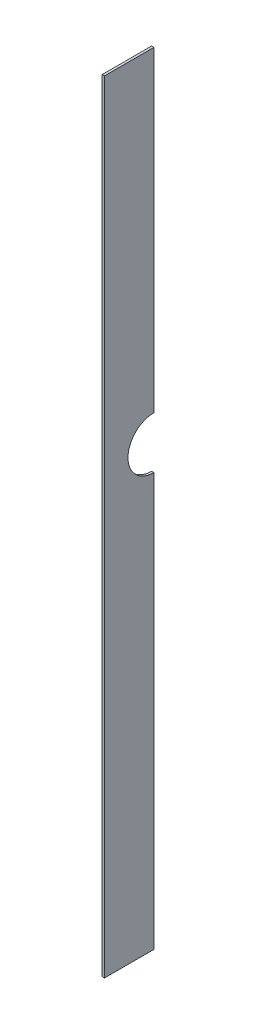
ISO-10303-21;
HEADER;
FILE_DESCRIPTION(('STEP AP214'),'2;1');
FILE_NAME('part.step','',(''),(''),'','','');
FILE_SCHEMA(('AUTOMOTIVE_DESIGN { 1 0 10303 214 1 1 1 1 }'));
ENDSEC;
DATA;
#1=APPLICATION_CONTEXT('core data for automotive mechanical design processes');
#2=APPLICATION_PROTOCOL_DEFINITION('international standard','automotive_design',2000,#1);
#3=PRODUCT_CONTEXT('',#1,'mechanical');
#4=PRODUCT('Part','Part','',(#3));
#5=PRODUCT_RELATED_PRODUCT_CATEGORY('part','',(#4));
#6=PRODUCT_DEFINITION_FORMATION('','',#4);
#7=PRODUCT_DEFINITION_CONTEXT('part definition',#1,'design');
#8=PRODUCT_DEFINITION('design','',#6,#7);
#9=PRODUCT_DEFINITION_SHAPE('','',#8);
#10=(LENGTH_UNIT() NAMED_UNIT(*) SI_UNIT(.MILLI.,.METRE.));
#11=(NAMED_UNIT(*) PLANE_ANGLE_UNIT() SI_UNIT($,.RADIAN.));
#12=(NAMED_UNIT(*) SI_UNIT($,.STERADIAN.) SOLID_ANGLE_UNIT());
#13=UNCERTAINTY_MEASURE_WITH_UNIT(LENGTH_MEASURE(1.E-05),#10,'distance_accuracy_value','');
#14=(GEOMETRIC_REPRESENTATION_CONTEXT(3) GLOBAL_UNCERTAINTY_ASSIGNED_CONTEXT((#13)) GLOBAL_UNIT_ASSIGNED_CONTEXT((#10,
#11,#12)) REPRESENTATION_CONTEXT('',''));
#15=CARTESIAN_POINT('',(0.,0.,0.));
#16=DIRECTION('',(0.,0.,1.));
#17=DIRECTION('',(1.,0.,0.));
#18=AXIS2_PLACEMENT_3D('',#15,#16,#17);
#19=CARTESIAN_POINT('',(-907.999999999999,-728.,-906.));
#20=DIRECTION('',(0.,0.,-1.));
#21=DIRECTION('',(-1.,0.,0.));
#22=AXIS2_PLACEMENT_3D('',#19,#20,#21);
#23=PLANE('',#22);
#24=DIRECTION('',(1.,0.,0.));
#25=VECTOR('',#24,1.);
#26=CARTESIAN_POINT('',(-14.9999999999999,-328.,-906.));
#27=LINE('',#26,#25);
#28=CARTESIAN_POINT('',(13.0000000000001,-328.,-906.));
#29=VERTEX_POINT('',#28);
#30=CARTESIAN_POINT('',(15.0000000000001,-328.,-906.));
#31=VERTEX_POINT('',#30);
#32=EDGE_CURVE('E48',#29,#31,#27,.T.);
#33=ORIENTED_EDGE('',*,*,#32,.F.);
#34=DIRECTION('',(0.,-1.,0.));
#35=VECTOR('',#34,1.);
#36=CARTESIAN_POINT('',(13.0000000000001,-58.9999999999999,-906.));
#37=LINE('',#36,#35);
#38=CARTESIAN_POINT('',(13.0000000000001,-58.9999999999999,-906.));
#39=VERTEX_POINT('',#38);
#40=EDGE_CURVE('E114',#39,#29,#37,.T.);
#41=ORIENTED_EDGE('',*,*,#40,.F.);
#42=DIRECTION('',(-1.,0.,0.));
#43=VECTOR('',#42,1.);
#44=CARTESIAN_POINT('',(15.0000000000001,-58.9999999999999,-906.));
#45=LINE('',#44,#43);
#46=CARTESIAN_POINT('',(15.0000000000001,-58.9999999999999,-906.));
#47=VERTEX_POINT('',#46);
#48=EDGE_CURVE('E81',#47,#39,#45,.T.);
#49=ORIENTED_EDGE('',*,*,#48,.F.);
#50=DIRECTION('',(0.,-1.,0.));
#51=VECTOR('',#50,1.);
#52=CARTESIAN_POINT('',(15.0000000000001,-58.9999999999999,-906.));
#53=LINE('',#52,#51);
#54=EDGE_CURVE('E105',#47,#31,#53,.T.);
#55=ORIENTED_EDGE('',*,*,#54,.T.);
#56=EDGE_LOOP('',(#33,#41,#49,#55));
#57=FACE_BOUND('',#56,.T.);
#58=ADVANCED_FACE('F32',(#57),#23,.T.);
#59=DIRECTION('',(1.,0.,0.));
#60=VECTOR('',#59,1.);
#61=CARTESIAN_POINT('',(-14.9999999999999,-372.,-906.));
#62=LINE('',#61,#60);
#63=CARTESIAN_POINT('',(15.0000000000001,-372.,-906.));
#64=VERTEX_POINT('',#63);
#65=CARTESIAN_POINT('',(13.0000000000001,-372.,-906.));
#66=VERTEX_POINT('',#65);
#67=EDGE_CURVE('E92',#64,#66,#62,.F.);
#68=ORIENTED_EDGE('',*,*,#67,.F.);
#69=CARTESIAN_POINT('',(15.0000000000001,-723.,-906.));
#70=VERTEX_POINT('',#69);
#71=EDGE_CURVE('E98',#64,#70,#53,.T.);
#72=ORIENTED_EDGE('',*,*,#71,.T.);
#73=DIRECTION('',(1.,0.,0.));
#74=VECTOR('',#73,1.);
#75=CARTESIAN_POINT('',(13.0000000000001,-723.,-906.));
#76=LINE('',#75,#74);
#77=CARTESIAN_POINT('',(13.0000000000001,-723.,-906.));
#78=VERTEX_POINT('',#77);
#79=EDGE_CURVE('E111',#78,#70,#76,.T.);
#80=ORIENTED_EDGE('',*,*,#79,.F.);
#81=EDGE_CURVE('E100',#66,#78,#37,.T.);
#82=ORIENTED_EDGE('',*,*,#81,.F.);
#83=EDGE_LOOP('',(#68,#72,#80,#82));
#84=FACE_BOUND('',#83,.T.);
#85=ADVANCED_FACE('F34',(#84),#23,.T.);
#86=CARTESIAN_POINT('',(0.,0.,-864.));
#87=DIRECTION('',(0.,0.,1.));
#88=DIRECTION('',(1.,0.,0.));
#89=AXIS2_PLACEMENT_3D('',#86,#87,#88);
#90=PLANE('',#89);
#91=DIRECTION('',(0.,-1.,0.));
#92=VECTOR('',#91,1.);
#93=CARTESIAN_POINT('',(15.0000000000001,-58.9999999999999,-864.));
#94=LINE('',#93,#92);
#95=CARTESIAN_POINT('',(15.0000000000001,-58.9999999999999,-864.));
#96=VERTEX_POINT('',#95);
#97=CARTESIAN_POINT('',(15.0000000000001,-723.,-864.));
#98=VERTEX_POINT('',#97);
#99=EDGE_CURVE('E11',#96,#98,#94,.T.);
#100=ORIENTED_EDGE('',*,*,#99,.F.);
#101=DIRECTION('',(-1.,0.,0.));
#102=VECTOR('',#101,1.);
#103=CARTESIAN_POINT('',(15.0000000000001,-58.9999999999999,-864.));
#104=LINE('',#103,#102);
#105=CARTESIAN_POINT('',(13.0000000000001,-58.9999999999999,-864.));
#106=VERTEX_POINT('',#105);
#107=EDGE_CURVE('E107',#96,#106,#104,.T.);
#108=ORIENTED_EDGE('',*,*,#107,.T.);
#109=DIRECTION('',(0.,-1.,0.));
#110=VECTOR('',#109,1.);
#111=CARTESIAN_POINT('',(13.0000000000001,-58.9999999999999,-864.));
#112=LINE('',#111,#110);
#113=CARTESIAN_POINT('',(13.0000000000001,-723.,-864.));
#114=VERTEX_POINT('',#113);
#115=EDGE_CURVE('E125',#106,#114,#112,.T.);
#116=ORIENTED_EDGE('',*,*,#115,.T.);
#117=DIRECTION('',(1.,0.,0.));
#118=VECTOR('',#117,1.);
#119=CARTESIAN_POINT('',(13.0000000000001,-723.,-864.));
#120=LINE('',#119,#118);
#121=EDGE_CURVE('E123',#114,#98,#120,.T.);
#122=ORIENTED_EDGE('',*,*,#121,.T.);
#123=EDGE_LOOP('',(#100,#108,#116,#122));
#124=FACE_BOUND('',#123,.T.);
#125=ADVANCED_FACE('F134',(#124),#90,.T.);
#126=CARTESIAN_POINT('',(15.0000000000001,-58.9999999999999,-1570.00301204136));
#127=DIRECTION('',(0.,1.,0.));
#128=DIRECTION('',(0.,0.,1.));
#129=AXIS2_PLACEMENT_3D('',#126,#127,#128);
#130=PLANE('',#129);
#131=DIRECTION('',(0.,0.,1.));
#132=VECTOR('',#131,1.);
#133=CARTESIAN_POINT('',(15.0000000000001,-58.9999999999999,-1570.00301204136));
#134=LINE('',#133,#132);
#135=EDGE_CURVE('E36',#47,#96,#134,.T.);
#136=ORIENTED_EDGE('',*,*,#135,.F.);
#137=ORIENTED_EDGE('',*,*,#48,.T.);
#138=DIRECTION('',(0.,0.,1.));
#139=VECTOR('',#138,1.);
#140=CARTESIAN_POINT('',(13.0000000000001,-58.9999999999999,-1570.00301204136));
#141=LINE('',#140,#139);
#142=EDGE_CURVE('E118',#39,#106,#141,.T.);
#143=ORIENTED_EDGE('',*,*,#142,.T.);
#144=ORIENTED_EDGE('',*,*,#107,.F.);
#145=EDGE_LOOP('',(#136,#137,#143,#144));
#146=FACE_BOUND('',#145,.T.);
#147=ADVANCED_FACE('F135',(#146),#130,.T.);
#148=CARTESIAN_POINT('',(13.0000000000001,-58.9999999999999,-1570.00301204136));
#149=DIRECTION('',(-1.,0.,0.));
#150=DIRECTION('',(0.,-1.,0.));
#151=AXIS2_PLACEMENT_3D('',#148,#149,#150);
#152=PLANE('',#151);
#153=CARTESIAN_POINT('',(13.0000000000001,-350.,-906.));
#154=DIRECTION('',(-1.,0.,0.));
#155=DIRECTION('',(0.,-1.,0.));
#156=AXIS2_PLACEMENT_3D('',#153,#154,#155);
#157=CIRCLE('',#156,22.0000000000001);
#158=EDGE_CURVE('E85',#66,#29,#157,.T.);
#159=ORIENTED_EDGE('',*,*,#158,.F.);
#160=ORIENTED_EDGE('',*,*,#81,.T.);
#161=DIRECTION('',(0.,0.,1.));
#162=VECTOR('',#161,1.);
#163=CARTESIAN_POINT('',(13.0000000000001,-723.,-1570.00301204136));
#164=LINE('',#163,#162);
#165=EDGE_CURVE('E113',#78,#114,#164,.T.);
#166=ORIENTED_EDGE('',*,*,#165,.T.);
#167=ORIENTED_EDGE('',*,*,#115,.F.);
#168=ORIENTED_EDGE('',*,*,#142,.F.);
#169=ORIENTED_EDGE('',*,*,#40,.T.);
#170=EDGE_LOOP('',(#159,#160,#166,#167,#168,#169));
#171=FACE_BOUND('',#170,.T.);
#172=ADVANCED_FACE('F137',(#171),#152,.T.);
#173=CARTESIAN_POINT('',(13.0000000000001,-723.,-1570.00301204136));
#174=DIRECTION('',(0.,-1.,0.));
#175=DIRECTION('',(0.,0.,-1.));
#176=AXIS2_PLACEMENT_3D('',#173,#174,#175);
#177=PLANE('',#176);
#178=ORIENTED_EDGE('',*,*,#165,.F.);
#179=ORIENTED_EDGE('',*,*,#79,.T.);
#180=DIRECTION('',(0.,0.,1.));
#181=VECTOR('',#180,1.);
#182=CARTESIAN_POINT('',(15.0000000000001,-723.,-1570.00301204136));
#183=LINE('',#182,#181);
#184=EDGE_CURVE('E103',#70,#98,#183,.T.);
#185=ORIENTED_EDGE('',*,*,#184,.T.);
#186=ORIENTED_EDGE('',*,*,#121,.F.);
#187=EDGE_LOOP('',(#178,#179,#185,#186));
#188=FACE_BOUND('',#187,.T.);
#189=ADVANCED_FACE('F142',(#188),#177,.T.);
#190=CARTESIAN_POINT('',(15.0000000000001,-58.9999999999999,-1570.00301204136));
#191=DIRECTION('',(-1.,0.,0.));
#192=DIRECTION('',(0.,-1.,0.));
#193=AXIS2_PLACEMENT_3D('',#190,#191,#192);
#194=PLANE('',#193);
#195=ORIENTED_EDGE('',*,*,#71,.F.);
#196=CARTESIAN_POINT('',(15.0000000000001,-350.,-906.));
#197=DIRECTION('',(1.,0.,0.));
#198=DIRECTION('',(0.,0.,-1.));
#199=AXIS2_PLACEMENT_3D('',#196,#197,#198);
#200=CIRCLE('',#199,22.0000000000001);
#201=EDGE_CURVE('E89',#31,#64,#200,.T.);
#202=ORIENTED_EDGE('',*,*,#201,.F.);
#203=ORIENTED_EDGE('',*,*,#54,.F.);
#204=ORIENTED_EDGE('',*,*,#135,.T.);
#205=ORIENTED_EDGE('',*,*,#99,.T.);
#206=ORIENTED_EDGE('',*,*,#184,.F.);
#207=EDGE_LOOP('',(#195,#202,#203,#204,#205,#206));
#208=FACE_BOUND('',#207,.T.);
#209=ADVANCED_FACE('F102',(#208),#194,.F.);
#210=CARTESIAN_POINT('',(-14.9999999999999,-350.,-906.));
#211=DIRECTION('',(1.,0.,0.));
#212=DIRECTION('',(0.,0.,-1.));
#213=AXIS2_PLACEMENT_3D('',#210,#211,#212);
#214=CYLINDRICAL_SURFACE('',#213,22.0000000000001);
#215=ORIENTED_EDGE('',*,*,#32,.T.);
#216=ORIENTED_EDGE('',*,*,#201,.T.);
#217=ORIENTED_EDGE('',*,*,#67,.T.);
#218=ORIENTED_EDGE('',*,*,#158,.T.);
#219=EDGE_LOOP('',(#215,#216,#217,#218));
#220=FACE_BOUND('',#219,.T.);
#221=ADVANCED_FACE('F91',(#220),#214,.F.);
#222=CLOSED_SHELL('',(#58,#85,#125,#147,#172,#189,#209,#221));
#223=MANIFOLD_SOLID_BREP('B2',#222);
#224=ADVANCED_BREP_SHAPE_REPRESENTATION('',(#18,#223),#14);
#225=SHAPE_DEFINITION_REPRESENTATION(#9,#224);
ENDSEC;
END-ISO-10303-21;
